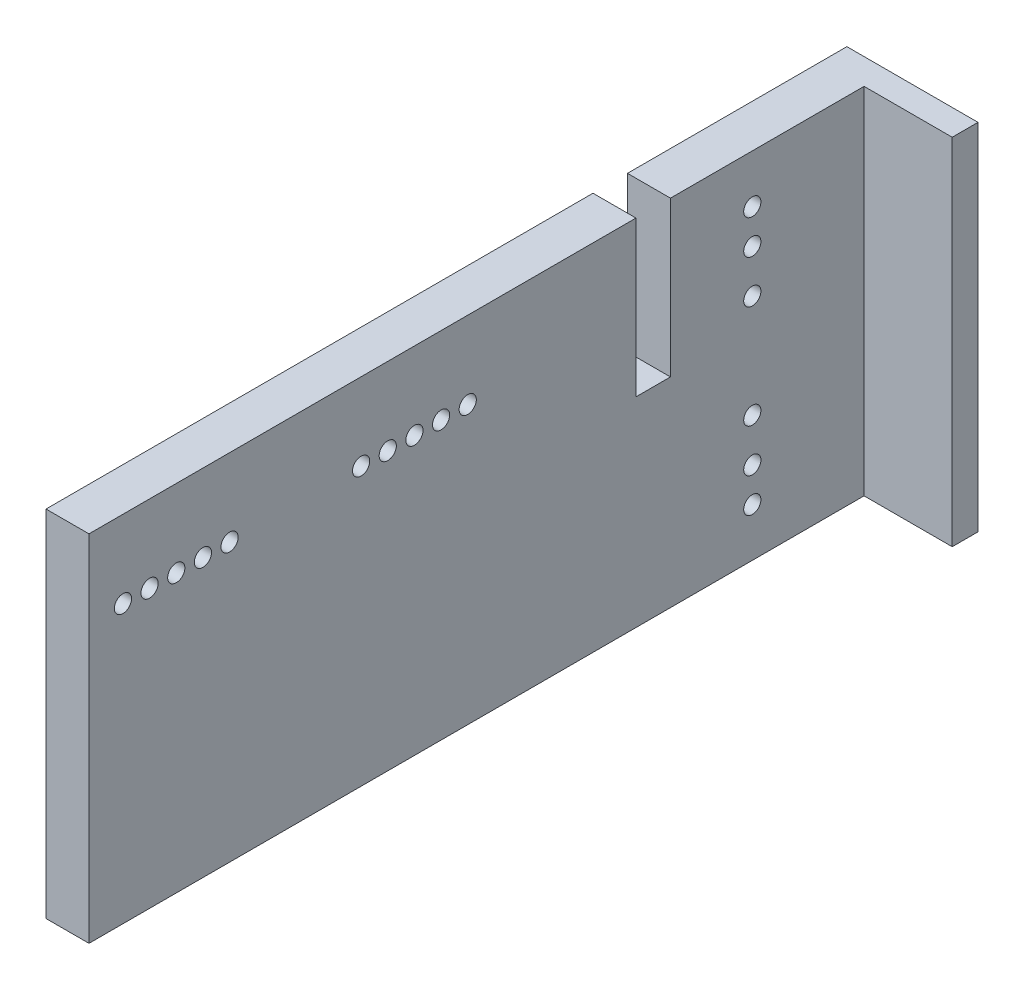
ISO-10303-21;
HEADER;
FILE_DESCRIPTION(('STEP AP214'),'2;1');
FILE_NAME('part.step','',(''),(''),'','','');
FILE_SCHEMA(('AUTOMOTIVE_DESIGN { 1 0 10303 214 1 1 1 1 }'));
ENDSEC;
DATA;
#1=APPLICATION_CONTEXT('core data for automotive mechanical design processes');
#2=APPLICATION_PROTOCOL_DEFINITION('international standard','automotive_design',2000,#1);
#3=PRODUCT_CONTEXT('',#1,'mechanical');
#4=PRODUCT('Part','Part','',(#3));
#5=PRODUCT_RELATED_PRODUCT_CATEGORY('part','',(#4));
#6=PRODUCT_DEFINITION_FORMATION('','',#4);
#7=PRODUCT_DEFINITION_CONTEXT('part definition',#1,'design');
#8=PRODUCT_DEFINITION('design','',#6,#7);
#9=PRODUCT_DEFINITION_SHAPE('','',#8);
#10=(LENGTH_UNIT() NAMED_UNIT(*) SI_UNIT(.MILLI.,.METRE.));
#11=(NAMED_UNIT(*) PLANE_ANGLE_UNIT() SI_UNIT($,.RADIAN.));
#12=(NAMED_UNIT(*) SI_UNIT($,.STERADIAN.) SOLID_ANGLE_UNIT());
#13=UNCERTAINTY_MEASURE_WITH_UNIT(LENGTH_MEASURE(1.E-05),#10,'distance_accuracy_value','');
#14=(GEOMETRIC_REPRESENTATION_CONTEXT(3) GLOBAL_UNCERTAINTY_ASSIGNED_CONTEXT((#13)) GLOBAL_UNIT_ASSIGNED_CONTEXT((#10,
#11,#12)) REPRESENTATION_CONTEXT('',''));
#15=CARTESIAN_POINT('',(0.,0.,0.));
#16=DIRECTION('',(0.,0.,1.));
#17=DIRECTION('',(1.,0.,0.));
#18=AXIS2_PLACEMENT_3D('',#15,#16,#17);
#19=CARTESIAN_POINT('',(10.25,20.625,13.));
#20=DIRECTION('',(1.,0.,0.));
#21=DIRECTION('',(0.,0.,1.));
#22=AXIS2_PLACEMENT_3D('',#19,#20,#21);
#23=PLANE('',#22);
#24=DIRECTION('',(0.,0.,-1.));
#25=VECTOR('',#24,1.);
#26=CARTESIAN_POINT('',(10.25,41.25,54.7901162303077));
#27=LINE('',#26,#25);
#28=CARTESIAN_POINT('',(10.25,41.25,0.));
#29=VERTEX_POINT('',#28);
#30=CARTESIAN_POINT('',(10.25,41.25,-3.));
#31=VERTEX_POINT('',#30);
#32=EDGE_CURVE('E180',#29,#31,#27,.T.);
#33=ORIENTED_EDGE('',*,*,#32,.F.);
#34=DIRECTION('',(0.,-1.,0.));
#35=VECTOR('',#34,1.);
#36=CARTESIAN_POINT('',(10.25,44.25,0.));
#37=LINE('',#36,#35);
#38=CARTESIAN_POINT('',(10.25,0.,0.));
#39=VERTEX_POINT('',#38);
#40=EDGE_CURVE('E11',#29,#39,#37,.T.);
#41=ORIENTED_EDGE('',*,*,#40,.T.);
#42=DIRECTION('',(0.,0.,1.));
#43=VECTOR('',#42,1.);
#44=CARTESIAN_POINT('',(10.25,0.,40.9842246334762));
#45=LINE('',#44,#43);
#46=CARTESIAN_POINT('',(10.25,0.,-3.));
#47=VERTEX_POINT('',#46);
#48=EDGE_CURVE('E199',#47,#39,#45,.T.);
#49=ORIENTED_EDGE('',*,*,#48,.F.);
#50=DIRECTION('',(0.,-1.,0.));
#51=VECTOR('',#50,1.);
#52=CARTESIAN_POINT('',(10.25,44.25,-3.));
#53=LINE('',#52,#51);
#54=EDGE_CURVE('E196',#31,#47,#53,.T.);
#55=ORIENTED_EDGE('',*,*,#54,.F.);
#56=EDGE_LOOP('',(#33,#41,#49,#55));
#57=FACE_BOUND('',#56,.T.);
#58=ADVANCED_FACE('F43',(#57),#23,.T.);
#59=CARTESIAN_POINT('',(-5.,44.25,0.));
#60=DIRECTION('',(-1.,0.,0.));
#61=DIRECTION('',(0.,0.,1.));
#62=AXIS2_PLACEMENT_3D('',#59,#60,#61);
#63=PLANE('',#62);
#64=DIRECTION('',(0.,0.,-1.));
#65=VECTOR('',#64,1.);
#66=CARTESIAN_POINT('',(-5.00000000000001,41.25,54.7901162303077));
#67=LINE('',#66,#65);
#68=CARTESIAN_POINT('',(-5.00000000000001,41.25,22.5204663648322));
#69=VERTEX_POINT('',#68);
#70=CARTESIAN_POINT('',(-5.00000000000001,41.25,-3.));
#71=VERTEX_POINT('',#70);
#72=EDGE_CURVE('E198',#69,#71,#67,.T.);
#73=ORIENTED_EDGE('',*,*,#72,.T.);
#74=DIRECTION('',(0.,-1.,0.));
#75=VECTOR('',#74,1.);
#76=CARTESIAN_POINT('',(-5.,-3.,-3.));
#77=LINE('',#76,#75);
#78=CARTESIAN_POINT('',(-5.00000000000001,0.,-3.));
#79=VERTEX_POINT('',#78);
#80=EDGE_CURVE('E189',#71,#79,#77,.T.);
#81=ORIENTED_EDGE('',*,*,#80,.T.);
#82=DIRECTION('',(0.,0.,-1.));
#83=VECTOR('',#82,1.);
#84=CARTESIAN_POINT('',(-5.,0.,90.15));
#85=LINE('',#84,#83);
#86=CARTESIAN_POINT('',(-5.,0.,90.15));
#87=VERTEX_POINT('',#86);
#88=EDGE_CURVE('E704',#87,#79,#85,.T.);
#89=ORIENTED_EDGE('',*,*,#88,.F.);
#90=DIRECTION('',(0.,-1.,0.));
#91=VECTOR('',#90,1.);
#92=CARTESIAN_POINT('',(-5.00000000000001,41.25,90.15));
#93=LINE('',#92,#91);
#94=CARTESIAN_POINT('',(-5.00000000000001,41.25,90.15));
#95=VERTEX_POINT('',#94);
#96=EDGE_CURVE('E711',#95,#87,#93,.T.);
#97=ORIENTED_EDGE('',*,*,#96,.F.);
#98=DIRECTION('',(0.,0.,-1.));
#99=VECTOR('',#98,1.);
#100=CARTESIAN_POINT('',(-5.00000000000001,41.25,90.15));
#101=LINE('',#100,#99);
#102=CARTESIAN_POINT('',(-5.00000000000001,41.25,26.5304663648323));
#103=VERTEX_POINT('',#102);
#104=EDGE_CURVE('E61',#95,#103,#101,.T.);
#105=ORIENTED_EDGE('',*,*,#104,.T.);
#106=DIRECTION('',(0.,-1.,0.));
#107=VECTOR('',#106,1.);
#108=CARTESIAN_POINT('',(-5.00000000000001,41.25,26.5304663648323));
#109=LINE('',#108,#107);
#110=CARTESIAN_POINT('',(-5.00000000000001,23.24,26.5304663648322));
#111=VERTEX_POINT('',#110);
#112=EDGE_CURVE('E832',#103,#111,#109,.T.);
#113=ORIENTED_EDGE('',*,*,#112,.T.);
#114=DIRECTION('',(0.,0.,-1.));
#115=VECTOR('',#114,1.);
#116=CARTESIAN_POINT('',(-5.00000000000001,23.24,22.5204663648322));
#117=LINE('',#116,#115);
#118=CARTESIAN_POINT('',(-5.00000000000001,23.24,22.5204663648322));
#119=VERTEX_POINT('',#118);
#120=EDGE_CURVE('E806',#111,#119,#117,.T.);
#121=ORIENTED_EDGE('',*,*,#120,.T.);
#122=DIRECTION('',(0.,1.,0.));
#123=VECTOR('',#122,1.);
#124=CARTESIAN_POINT('',(-5.00000000000001,41.25,22.5204663648322));
#125=LINE('',#124,#123);
#126=EDGE_CURVE('E819',#119,#69,#125,.T.);
#127=ORIENTED_EDGE('',*,*,#126,.T.);
#128=EDGE_LOOP('',(#73,#81,#89,#97,#105,#113,#121,#127));
#129=FACE_BOUND('',#128,.T.);
#130=CARTESIAN_POINT('',(-5.00000000000001,32.25,86.2));
#131=DIRECTION('',(1.,0.,0.));
#132=DIRECTION('',(0.,0.,-1.));
#133=AXIS2_PLACEMENT_3D('',#130,#131,#132);
#134=CIRCLE('',#133,0.999999999999998);
#135=CARTESIAN_POINT('',(-5.00000000000001,32.25,85.2));
#136=VERTEX_POINT('',#135);
#137=EDGE_CURVE('E721',#136,#136,#134,.T.);
#138=ORIENTED_EDGE('',*,*,#137,.T.);
#139=EDGE_LOOP('',(#138));
#140=FACE_BOUND('',#139,.T.);
#141=CARTESIAN_POINT('',(-5.00000000000001,32.25,49.2000000000001));
#142=DIRECTION('',(1.,0.,0.));
#143=DIRECTION('',(0.,0.,-1.));
#144=AXIS2_PLACEMENT_3D('',#141,#142,#143);
#145=CIRCLE('',#144,0.999999999999998);
#146=CARTESIAN_POINT('',(-5.00000000000001,32.25,48.2));
#147=VERTEX_POINT('',#146);
#148=EDGE_CURVE('E769',#147,#147,#145,.T.);
#149=ORIENTED_EDGE('',*,*,#148,.T.);
#150=EDGE_LOOP('',(#149));
#151=FACE_BOUND('',#150,.T.);
#152=CARTESIAN_POINT('',(-5.00000000000001,32.25,52.3));
#153=DIRECTION('',(1.,0.,0.));
#154=DIRECTION('',(0.,0.,-1.));
#155=AXIS2_PLACEMENT_3D('',#152,#153,#154);
#156=CIRCLE('',#155,0.999999999999998);
#157=CARTESIAN_POINT('',(-5.00000000000001,32.25,51.3));
#158=VERTEX_POINT('',#157);
#159=EDGE_CURVE('E777',#158,#158,#156,.T.);
#160=ORIENTED_EDGE('',*,*,#159,.T.);
#161=EDGE_LOOP('',(#160));
#162=FACE_BOUND('',#161,.T.);
#163=CARTESIAN_POINT('',(-5.00000000000001,32.25,55.4));
#164=DIRECTION('',(1.,0.,0.));
#165=DIRECTION('',(0.,0.,-1.));
#166=AXIS2_PLACEMENT_3D('',#163,#164,#165);
#167=CIRCLE('',#166,0.999999999999998);
#168=CARTESIAN_POINT('',(-5.00000000000001,32.25,54.4));
#169=VERTEX_POINT('',#168);
#170=EDGE_CURVE('E785',#169,#169,#167,.T.);
#171=ORIENTED_EDGE('',*,*,#170,.T.);
#172=EDGE_LOOP('',(#171));
#173=FACE_BOUND('',#172,.T.);
#174=CARTESIAN_POINT('',(-5.00000000000001,32.25,73.8));
#175=DIRECTION('',(1.,0.,0.));
#176=DIRECTION('',(0.,0.,-1.));
#177=AXIS2_PLACEMENT_3D('',#174,#175,#176);
#178=CIRCLE('',#177,0.999999999999998);
#179=CARTESIAN_POINT('',(-5.00000000000001,32.25,72.8));
#180=VERTEX_POINT('',#179);
#181=EDGE_CURVE('E755',#180,#180,#178,.T.);
#182=ORIENTED_EDGE('',*,*,#181,.T.);
#183=EDGE_LOOP('',(#182));
#184=FACE_BOUND('',#183,.T.);
#185=CARTESIAN_POINT('',(-5.00000000000001,32.25,58.5));
#186=DIRECTION('',(1.,0.,0.));
#187=DIRECTION('',(0.,0.,-1.));
#188=AXIS2_PLACEMENT_3D('',#185,#186,#187);
#189=CIRCLE('',#188,0.999999999999998);
#190=CARTESIAN_POINT('',(-5.00000000000001,32.25,57.5));
#191=VERTEX_POINT('',#190);
#192=EDGE_CURVE('E745',#191,#191,#189,.T.);
#193=ORIENTED_EDGE('',*,*,#192,.T.);
#194=EDGE_LOOP('',(#193));
#195=FACE_BOUND('',#194,.T.);
#196=CARTESIAN_POINT('',(-5.00000000000001,32.25,83.1));
#197=DIRECTION('',(1.,0.,0.));
#198=DIRECTION('',(0.,0.,-1.));
#199=AXIS2_PLACEMENT_3D('',#196,#197,#198);
#200=CIRCLE('',#199,0.999999999999998);
#201=CARTESIAN_POINT('',(-5.00000000000001,32.25,82.1));
#202=VERTEX_POINT('',#201);
#203=EDGE_CURVE('E736',#202,#202,#200,.T.);
#204=ORIENTED_EDGE('',*,*,#203,.T.);
#205=EDGE_LOOP('',(#204));
#206=FACE_BOUND('',#205,.T.);
#207=CARTESIAN_POINT('',(-5.00000000000001,32.25,80.));
#208=DIRECTION('',(1.,0.,0.));
#209=DIRECTION('',(0.,0.,-1.));
#210=AXIS2_PLACEMENT_3D('',#207,#208,#209);
#211=CIRCLE('',#210,0.999999999999998);
#212=CARTESIAN_POINT('',(-5.00000000000001,32.25,79.));
#213=VERTEX_POINT('',#212);
#214=EDGE_CURVE('E737',#213,#213,#211,.T.);
#215=ORIENTED_EDGE('',*,*,#214,.T.);
#216=EDGE_LOOP('',(#215));
#217=FACE_BOUND('',#216,.T.);
#218=CARTESIAN_POINT('',(-5.00000000000001,32.25,76.9));
#219=DIRECTION('',(1.,0.,0.));
#220=DIRECTION('',(0.,0.,-1.));
#221=AXIS2_PLACEMENT_3D('',#218,#219,#220);
#222=CIRCLE('',#221,0.999999999999998);
#223=CARTESIAN_POINT('',(-5.00000000000001,32.25,75.9));
#224=VERTEX_POINT('',#223);
#225=EDGE_CURVE('E754',#224,#224,#222,.T.);
#226=ORIENTED_EDGE('',*,*,#225,.T.);
#227=EDGE_LOOP('',(#226));
#228=FACE_BOUND('',#227,.T.);
#229=CARTESIAN_POINT('',(-5.00000000000001,32.25,46.1000000000001));
#230=DIRECTION('',(1.,0.,0.));
#231=DIRECTION('',(0.,0.,-1.));
#232=AXIS2_PLACEMENT_3D('',#229,#230,#231);
#233=CIRCLE('',#232,0.999999999999998);
#234=CARTESIAN_POINT('',(-5.00000000000001,32.25,45.1000000000001));
#235=VERTEX_POINT('',#234);
#236=EDGE_CURVE('E726',#235,#235,#233,.T.);
#237=ORIENTED_EDGE('',*,*,#236,.T.);
#238=EDGE_LOOP('',(#237));
#239=FACE_BOUND('',#238,.T.);
#240=CARTESIAN_POINT('',(-5.,35.625,13.));
#241=DIRECTION('',(1.,0.,0.));
#242=DIRECTION('',(0.,-1.,0.));
#243=AXIS2_PLACEMENT_3D('',#240,#241,#242);
#244=CIRCLE('',#243,1.);
#245=CARTESIAN_POINT('',(-5.,36.625,13.));
#246=VERTEX_POINT('',#245);
#247=EDGE_CURVE('E73',#246,#246,#244,.T.);
#248=ORIENTED_EDGE('',*,*,#247,.T.);
#249=EDGE_LOOP('',(#248));
#250=FACE_BOUND('',#249,.T.);
#251=CARTESIAN_POINT('',(-5.,31.625,13.));
#252=DIRECTION('',(1.,0.,0.));
#253=DIRECTION('',(0.,-1.,0.));
#254=AXIS2_PLACEMENT_3D('',#251,#252,#253);
#255=CIRCLE('',#254,1.);
#256=CARTESIAN_POINT('',(-5.,32.625,13.));
#257=VERTEX_POINT('',#256);
#258=EDGE_CURVE('E255',#257,#257,#255,.T.);
#259=ORIENTED_EDGE('',*,*,#258,.T.);
#260=EDGE_LOOP('',(#259));
#261=FACE_BOUND('',#260,.T.);
#262=CARTESIAN_POINT('',(-5.,26.625,13.));
#263=DIRECTION('',(1.,0.,0.));
#264=DIRECTION('',(0.,-1.,0.));
#265=AXIS2_PLACEMENT_3D('',#262,#263,#264);
#266=CIRCLE('',#265,1.);
#267=CARTESIAN_POINT('',(-5.,27.625,13.));
#268=VERTEX_POINT('',#267);
#269=EDGE_CURVE('E219',#268,#268,#266,.T.);
#270=ORIENTED_EDGE('',*,*,#269,.T.);
#271=EDGE_LOOP('',(#270));
#272=FACE_BOUND('',#271,.T.);
#273=CARTESIAN_POINT('',(-5.,5.625,13.));
#274=DIRECTION('',(1.,0.,0.));
#275=DIRECTION('',(0.,1.,0.));
#276=AXIS2_PLACEMENT_3D('',#273,#274,#275);
#277=CIRCLE('',#276,1.);
#278=CARTESIAN_POINT('',(-5.,4.625,13.));
#279=VERTEX_POINT('',#278);
#280=EDGE_CURVE('E278',#279,#279,#277,.T.);
#281=ORIENTED_EDGE('',*,*,#280,.T.);
#282=EDGE_LOOP('',(#281));
#283=FACE_BOUND('',#282,.T.);
#284=CARTESIAN_POINT('',(-5.,9.625,13.));
#285=DIRECTION('',(1.,0.,0.));
#286=DIRECTION('',(0.,1.,0.));
#287=AXIS2_PLACEMENT_3D('',#284,#285,#286);
#288=CIRCLE('',#287,1.);
#289=CARTESIAN_POINT('',(-5.,8.625,13.));
#290=VERTEX_POINT('',#289);
#291=EDGE_CURVE('E263',#290,#290,#288,.T.);
#292=ORIENTED_EDGE('',*,*,#291,.T.);
#293=EDGE_LOOP('',(#292));
#294=FACE_BOUND('',#293,.T.);
#295=CARTESIAN_POINT('',(-5.,14.625,13.));
#296=DIRECTION('',(1.,0.,0.));
#297=DIRECTION('',(0.,1.,0.));
#298=AXIS2_PLACEMENT_3D('',#295,#296,#297);
#299=CIRCLE('',#298,1.);
#300=CARTESIAN_POINT('',(-5.,13.625,13.));
#301=VERTEX_POINT('',#300);
#302=EDGE_CURVE('E259',#301,#301,#299,.T.);
#303=ORIENTED_EDGE('',*,*,#302,.T.);
#304=EDGE_LOOP('',(#303));
#305=FACE_BOUND('',#304,.T.);
#306=ADVANCED_FACE('F290',(#129,#140,#151,#162,#173,#184,#195,#206,#217,#228,#239,#250,#261,
#272,#283,#294,#305),#63,.T.);
#307=CARTESIAN_POINT('',(3.625,20.625,-3.));
#308=DIRECTION('',(0.,0.,-1.));
#309=DIRECTION('',(0.,-1.,0.));
#310=AXIS2_PLACEMENT_3D('',#307,#308,#309);
#311=PLANE('',#310);
#312=DIRECTION('',(-1.,0.,0.));
#313=VECTOR('',#312,1.);
#314=CARTESIAN_POINT('',(3.625,41.25,-3.));
#315=LINE('',#314,#313);
#316=EDGE_CURVE('E840',#31,#71,#315,.T.);
#317=ORIENTED_EDGE('',*,*,#316,.F.);
#318=ORIENTED_EDGE('',*,*,#54,.T.);
#319=DIRECTION('',(1.,0.,0.));
#320=VECTOR('',#319,1.);
#321=CARTESIAN_POINT('',(3.625,0.,-3.));
#322=LINE('',#321,#320);
#323=EDGE_CURVE('E828',#79,#47,#322,.T.);
#324=ORIENTED_EDGE('',*,*,#323,.F.);
#325=ORIENTED_EDGE('',*,*,#80,.F.);
#326=EDGE_LOOP('',(#317,#318,#324,#325));
#327=FACE_BOUND('',#326,.T.);
#328=ADVANCED_FACE('F45',(#327),#311,.T.);
#329=CARTESIAN_POINT('',(3.625,20.625,0.));
#330=DIRECTION('',(0.,0.,-1.));
#331=DIRECTION('',(0.,-1.,0.));
#332=AXIS2_PLACEMENT_3D('',#329,#330,#331);
#333=PLANE('',#332);
#334=ORIENTED_EDGE('',*,*,#40,.F.);
#335=DIRECTION('',(1.,0.,0.));
#336=VECTOR('',#335,1.);
#337=CARTESIAN_POINT('',(20.5,41.25,0.));
#338=LINE('',#337,#336);
#339=CARTESIAN_POINT('',(0.,41.25,0.));
#340=VERTEX_POINT('',#339);
#341=EDGE_CURVE('E53',#340,#29,#338,.T.);
#342=ORIENTED_EDGE('',*,*,#341,.F.);
#343=DIRECTION('',(0.,1.,0.));
#344=VECTOR('',#343,1.);
#345=CARTESIAN_POINT('',(0.,41.25,0.));
#346=LINE('',#345,#344);
#347=CARTESIAN_POINT('',(0.,0.,0.));
#348=VERTEX_POINT('',#347);
#349=EDGE_CURVE('E203',#348,#340,#346,.T.);
#350=ORIENTED_EDGE('',*,*,#349,.F.);
#351=DIRECTION('',(-1.,0.,0.));
#352=VECTOR('',#351,1.);
#353=CARTESIAN_POINT('',(0.,0.,0.));
#354=LINE('',#353,#352);
#355=EDGE_CURVE('E202',#39,#348,#354,.T.);
#356=ORIENTED_EDGE('',*,*,#355,.F.);
#357=EDGE_LOOP('',(#334,#342,#350,#356));
#358=FACE_BOUND('',#357,.T.);
#359=ADVANCED_FACE('F201',(#358),#333,.F.);
#360=CARTESIAN_POINT('',(0.,35.625,13.));
#361=DIRECTION('',(-1.,0.,0.));
#362=DIRECTION('',(0.,-1.,0.));
#363=AXIS2_PLACEMENT_3D('',#360,#361,#362);
#364=CYLINDRICAL_SURFACE('',#363,1.);
#365=CARTESIAN_POINT('',(0.,35.625,13.));
#366=DIRECTION('',(-1.,0.,0.));
#367=DIRECTION('',(0.,-1.,0.));
#368=AXIS2_PLACEMENT_3D('',#365,#366,#367);
#369=CIRCLE('',#368,1.);
#370=CARTESIAN_POINT('',(0.,36.625,13.));
#371=VERTEX_POINT('',#370);
#372=EDGE_CURVE('E47',#371,#371,#369,.T.);
#373=ORIENTED_EDGE('',*,*,#372,.F.);
#374=DIRECTION('',(-1.,0.,0.));
#375=VECTOR('',#374,1.);
#376=CARTESIAN_POINT('',(0.,36.625,13.));
#377=LINE('',#376,#375);
#378=EDGE_CURVE('E282',#371,#246,#377,.T.);
#379=ORIENTED_EDGE('',*,*,#378,.T.);
#380=ORIENTED_EDGE('',*,*,#247,.F.);
#381=ORIENTED_EDGE('',*,*,#378,.F.);
#382=EDGE_LOOP('',(#373,#379,#380,#381));
#383=FACE_BOUND('',#382,.T.);
#384=ADVANCED_FACE('F322',(#383),#364,.F.);
#385=CARTESIAN_POINT('',(0.,31.625,13.));
#386=DIRECTION('',(-1.,0.,0.));
#387=DIRECTION('',(0.,-1.,0.));
#388=AXIS2_PLACEMENT_3D('',#385,#386,#387);
#389=CYLINDRICAL_SURFACE('',#388,1.);
#390=CARTESIAN_POINT('',(0.,31.625,13.));
#391=DIRECTION('',(-1.,0.,0.));
#392=DIRECTION('',(0.,-1.,0.));
#393=AXIS2_PLACEMENT_3D('',#390,#391,#392);
#394=CIRCLE('',#393,1.);
#395=CARTESIAN_POINT('',(0.,32.625,13.));
#396=VERTEX_POINT('',#395);
#397=EDGE_CURVE('E250',#396,#396,#394,.T.);
#398=ORIENTED_EDGE('',*,*,#397,.F.);
#399=DIRECTION('',(-1.,0.,0.));
#400=VECTOR('',#399,1.);
#401=CARTESIAN_POINT('',(0.,32.625,13.));
#402=LINE('',#401,#400);
#403=EDGE_CURVE('E245',#396,#257,#402,.T.);
#404=ORIENTED_EDGE('',*,*,#403,.T.);
#405=ORIENTED_EDGE('',*,*,#258,.F.);
#406=ORIENTED_EDGE('',*,*,#403,.F.);
#407=EDGE_LOOP('',(#398,#404,#405,#406));
#408=FACE_BOUND('',#407,.T.);
#409=ADVANCED_FACE('F324',(#408),#389,.F.);
#410=CARTESIAN_POINT('',(0.,26.625,13.));
#411=DIRECTION('',(-1.,0.,0.));
#412=DIRECTION('',(0.,-1.,0.));
#413=AXIS2_PLACEMENT_3D('',#410,#411,#412);
#414=CYLINDRICAL_SURFACE('',#413,1.);
#415=CARTESIAN_POINT('',(0.,26.625,13.));
#416=DIRECTION('',(-1.,0.,0.));
#417=DIRECTION('',(0.,-1.,0.));
#418=AXIS2_PLACEMENT_3D('',#415,#416,#417);
#419=CIRCLE('',#418,1.);
#420=CARTESIAN_POINT('',(0.,27.625,13.));
#421=VERTEX_POINT('',#420);
#422=EDGE_CURVE('E233',#421,#421,#419,.T.);
#423=ORIENTED_EDGE('',*,*,#422,.F.);
#424=DIRECTION('',(-1.,0.,0.));
#425=VECTOR('',#424,1.);
#426=CARTESIAN_POINT('',(0.,27.625,13.));
#427=LINE('',#426,#425);
#428=EDGE_CURVE('E264',#421,#268,#427,.T.);
#429=ORIENTED_EDGE('',*,*,#428,.T.);
#430=ORIENTED_EDGE('',*,*,#269,.F.);
#431=ORIENTED_EDGE('',*,*,#428,.F.);
#432=EDGE_LOOP('',(#423,#429,#430,#431));
#433=FACE_BOUND('',#432,.T.);
#434=ADVANCED_FACE('F308',(#433),#414,.F.);
#435=CARTESIAN_POINT('',(0.,5.625,13.));
#436=DIRECTION('',(-1.,0.,0.));
#437=DIRECTION('',(0.,1.,0.));
#438=AXIS2_PLACEMENT_3D('',#435,#436,#437);
#439=CYLINDRICAL_SURFACE('',#438,1.);
#440=CARTESIAN_POINT('',(0.,5.625,13.));
#441=DIRECTION('',(-1.,0.,0.));
#442=DIRECTION('',(0.,1.,0.));
#443=AXIS2_PLACEMENT_3D('',#440,#441,#442);
#444=CIRCLE('',#443,1.);
#445=CARTESIAN_POINT('',(0.,4.625,13.));
#446=VERTEX_POINT('',#445);
#447=EDGE_CURVE('E225',#446,#446,#444,.T.);
#448=ORIENTED_EDGE('',*,*,#447,.F.);
#449=DIRECTION('',(-1.,0.,0.));
#450=VECTOR('',#449,1.);
#451=CARTESIAN_POINT('',(0.,4.625,13.));
#452=LINE('',#451,#450);
#453=EDGE_CURVE('E254',#446,#279,#452,.T.);
#454=ORIENTED_EDGE('',*,*,#453,.T.);
#455=ORIENTED_EDGE('',*,*,#280,.F.);
#456=ORIENTED_EDGE('',*,*,#453,.F.);
#457=EDGE_LOOP('',(#448,#454,#455,#456));
#458=FACE_BOUND('',#457,.T.);
#459=ADVANCED_FACE('F296',(#458),#439,.F.);
#460=CARTESIAN_POINT('',(0.,9.625,13.));
#461=DIRECTION('',(-1.,0.,0.));
#462=DIRECTION('',(0.,1.,0.));
#463=AXIS2_PLACEMENT_3D('',#460,#461,#462);
#464=CYLINDRICAL_SURFACE('',#463,1.);
#465=CARTESIAN_POINT('',(0.,9.625,13.));
#466=DIRECTION('',(-1.,0.,0.));
#467=DIRECTION('',(0.,1.,0.));
#468=AXIS2_PLACEMENT_3D('',#465,#466,#467);
#469=CIRCLE('',#468,1.);
#470=CARTESIAN_POINT('',(0.,8.625,13.));
#471=VERTEX_POINT('',#470);
#472=EDGE_CURVE('E222',#471,#471,#469,.T.);
#473=ORIENTED_EDGE('',*,*,#472,.F.);
#474=DIRECTION('',(-1.,0.,0.));
#475=VECTOR('',#474,1.);
#476=CARTESIAN_POINT('',(0.,8.625,13.));
#477=LINE('',#476,#475);
#478=EDGE_CURVE('E214',#471,#290,#477,.T.);
#479=ORIENTED_EDGE('',*,*,#478,.T.);
#480=ORIENTED_EDGE('',*,*,#291,.F.);
#481=ORIENTED_EDGE('',*,*,#478,.F.);
#482=EDGE_LOOP('',(#473,#479,#480,#481));
#483=FACE_BOUND('',#482,.T.);
#484=ADVANCED_FACE('F293',(#483),#464,.F.);
#485=CARTESIAN_POINT('',(0.,14.625,13.));
#486=DIRECTION('',(-1.,0.,0.));
#487=DIRECTION('',(0.,1.,0.));
#488=AXIS2_PLACEMENT_3D('',#485,#486,#487);
#489=CYLINDRICAL_SURFACE('',#488,1.);
#490=CARTESIAN_POINT('',(0.,14.625,13.));
#491=DIRECTION('',(-1.,0.,0.));
#492=DIRECTION('',(0.,1.,0.));
#493=AXIS2_PLACEMENT_3D('',#490,#491,#492);
#494=CIRCLE('',#493,1.);
#495=CARTESIAN_POINT('',(0.,13.625,13.));
#496=VERTEX_POINT('',#495);
#497=EDGE_CURVE('E226',#496,#496,#494,.T.);
#498=ORIENTED_EDGE('',*,*,#497,.F.);
#499=DIRECTION('',(-1.,0.,0.));
#500=VECTOR('',#499,1.);
#501=CARTESIAN_POINT('',(0.,13.625,13.));
#502=LINE('',#501,#500);
#503=EDGE_CURVE('E207',#496,#301,#502,.T.);
#504=ORIENTED_EDGE('',*,*,#503,.T.);
#505=ORIENTED_EDGE('',*,*,#302,.F.);
#506=ORIENTED_EDGE('',*,*,#503,.F.);
#507=EDGE_LOOP('',(#498,#504,#505,#506));
#508=FACE_BOUND('',#507,.T.);
#509=ADVANCED_FACE('F295',(#508),#489,.F.);
#510=CARTESIAN_POINT('',(0.,0.,0.));
#511=DIRECTION('',(1.,0.,0.));
#512=DIRECTION('',(0.,1.,0.));
#513=AXIS2_PLACEMENT_3D('',#510,#511,#512);
#514=PLANE('',#513);
#515=DIRECTION('',(0.,1.,0.));
#516=VECTOR('',#515,1.);
#517=CARTESIAN_POINT('',(0.,41.25,22.5204663648322));
#518=LINE('',#517,#516);
#519=CARTESIAN_POINT('',(0.,23.24,22.5204663648322));
#520=VERTEX_POINT('',#519);
#521=CARTESIAN_POINT('',(0.,41.25,22.5204663648322));
#522=VERTEX_POINT('',#521);
#523=EDGE_CURVE('E824',#520,#522,#518,.T.);
#524=ORIENTED_EDGE('',*,*,#523,.F.);
#525=DIRECTION('',(0.,0.,-1.));
#526=VECTOR('',#525,1.);
#527=CARTESIAN_POINT('',(0.,23.24,22.5204663648322));
#528=LINE('',#527,#526);
#529=CARTESIAN_POINT('',(0.,23.24,26.5304663648322));
#530=VERTEX_POINT('',#529);
#531=EDGE_CURVE('E815',#530,#520,#528,.T.);
#532=ORIENTED_EDGE('',*,*,#531,.F.);
#533=DIRECTION('',(0.,-1.,0.));
#534=VECTOR('',#533,1.);
#535=CARTESIAN_POINT('',(0.,41.25,26.5304663648323));
#536=LINE('',#535,#534);
#537=CARTESIAN_POINT('',(0.,41.25,26.5304663648323));
#538=VERTEX_POINT('',#537);
#539=EDGE_CURVE('E820',#538,#530,#536,.T.);
#540=ORIENTED_EDGE('',*,*,#539,.F.);
#541=DIRECTION('',(0.,0.,-1.));
#542=VECTOR('',#541,1.);
#543=CARTESIAN_POINT('',(0.,41.25,90.15));
#544=LINE('',#543,#542);
#545=CARTESIAN_POINT('',(0.,41.25,90.15));
#546=VERTEX_POINT('',#545);
#547=EDGE_CURVE('E236',#546,#538,#544,.T.);
#548=ORIENTED_EDGE('',*,*,#547,.F.);
#549=DIRECTION('',(0.,1.,0.));
#550=VECTOR('',#549,1.);
#551=CARTESIAN_POINT('',(0.,41.25,90.15));
#552=LINE('',#551,#550);
#553=CARTESIAN_POINT('',(0.,0.,90.15));
#554=VERTEX_POINT('',#553);
#555=EDGE_CURVE('E717',#554,#546,#552,.T.);
#556=ORIENTED_EDGE('',*,*,#555,.F.);
#557=DIRECTION('',(0.,0.,1.));
#558=VECTOR('',#557,1.);
#559=CARTESIAN_POINT('',(0.,0.,0.));
#560=LINE('',#559,#558);
#561=EDGE_CURVE('E208',#348,#554,#560,.T.);
#562=ORIENTED_EDGE('',*,*,#561,.F.);
#563=ORIENTED_EDGE('',*,*,#349,.T.);
#564=DIRECTION('',(0.,0.,1.));
#565=VECTOR('',#564,1.);
#566=CARTESIAN_POINT('',(0.,41.25,0.));
#567=LINE('',#566,#565);
#568=EDGE_CURVE('E183',#340,#522,#567,.T.);
#569=ORIENTED_EDGE('',*,*,#568,.T.);
#570=EDGE_LOOP('',(#524,#532,#540,#548,#556,#562,#563,#569));
#571=FACE_BOUND('',#570,.T.);
#572=CARTESIAN_POINT('',(0.,32.25,86.2));
#573=DIRECTION('',(1.,0.,0.));
#574=DIRECTION('',(0.,0.,-1.));
#575=AXIS2_PLACEMENT_3D('',#572,#573,#574);
#576=CIRCLE('',#575,0.999999999999998);
#577=CARTESIAN_POINT('',(0.,32.25,85.2));
#578=VERTEX_POINT('',#577);
#579=EDGE_CURVE('E749',#578,#578,#576,.T.);
#580=ORIENTED_EDGE('',*,*,#579,.F.);
#581=EDGE_LOOP('',(#580));
#582=FACE_BOUND('',#581,.T.);
#583=CARTESIAN_POINT('',(0.,32.25,49.2000000000001));
#584=DIRECTION('',(1.,0.,0.));
#585=DIRECTION('',(0.,0.,-1.));
#586=AXIS2_PLACEMENT_3D('',#583,#584,#585);
#587=CIRCLE('',#586,0.999999999999998);
#588=CARTESIAN_POINT('',(0.,32.25,48.2));
#589=VERTEX_POINT('',#588);
#590=EDGE_CURVE('E731',#589,#589,#587,.T.);
#591=ORIENTED_EDGE('',*,*,#590,.F.);
#592=EDGE_LOOP('',(#591));
#593=FACE_BOUND('',#592,.T.);
#594=CARTESIAN_POINT('',(0.,32.25,52.3));
#595=DIRECTION('',(1.,0.,0.));
#596=DIRECTION('',(0.,0.,-1.));
#597=AXIS2_PLACEMENT_3D('',#594,#595,#596);
#598=CIRCLE('',#597,0.999999999999998);
#599=CARTESIAN_POINT('',(0.,32.25,51.3));
#600=VERTEX_POINT('',#599);
#601=EDGE_CURVE('E773',#600,#600,#598,.T.);
#602=ORIENTED_EDGE('',*,*,#601,.F.);
#603=EDGE_LOOP('',(#602));
#604=FACE_BOUND('',#603,.T.);
#605=CARTESIAN_POINT('',(0.,32.25,55.4));
#606=DIRECTION('',(1.,0.,0.));
#607=DIRECTION('',(0.,0.,-1.));
#608=AXIS2_PLACEMENT_3D('',#605,#606,#607);
#609=CIRCLE('',#608,0.999999999999998);
#610=CARTESIAN_POINT('',(0.,32.25,54.4));
#611=VERTEX_POINT('',#610);
#612=EDGE_CURVE('E781',#611,#611,#609,.T.);
#613=ORIENTED_EDGE('',*,*,#612,.F.);
#614=EDGE_LOOP('',(#613));
#615=FACE_BOUND('',#614,.T.);
#616=CARTESIAN_POINT('',(0.,32.25,73.8));
#617=DIRECTION('',(1.,0.,0.));
#618=DIRECTION('',(0.,0.,-1.));
#619=AXIS2_PLACEMENT_3D('',#616,#617,#618);
#620=CIRCLE('',#619,0.999999999999998);
#621=CARTESIAN_POINT('',(0.,32.25,72.8));
#622=VERTEX_POINT('',#621);
#623=EDGE_CURVE('E789',#622,#622,#620,.T.);
#624=ORIENTED_EDGE('',*,*,#623,.F.);
#625=EDGE_LOOP('',(#624));
#626=FACE_BOUND('',#625,.T.);
#627=CARTESIAN_POINT('',(0.,32.25,58.5));
#628=DIRECTION('',(1.,0.,0.));
#629=DIRECTION('',(0.,0.,-1.));
#630=AXIS2_PLACEMENT_3D('',#627,#628,#629);
#631=CIRCLE('',#630,0.999999999999998);
#632=CARTESIAN_POINT('',(0.,32.25,57.5));
#633=VERTEX_POINT('',#632);
#634=EDGE_CURVE('E741',#633,#633,#631,.T.);
#635=ORIENTED_EDGE('',*,*,#634,.F.);
#636=EDGE_LOOP('',(#635));
#637=FACE_BOUND('',#636,.T.);
#638=CARTESIAN_POINT('',(0.,32.25,83.1));
#639=DIRECTION('',(1.,0.,0.));
#640=DIRECTION('',(0.,0.,-1.));
#641=AXIS2_PLACEMENT_3D('',#638,#639,#640);
#642=CIRCLE('',#641,0.999999999999998);
#643=CARTESIAN_POINT('',(0.,32.25,82.1));
#644=VERTEX_POINT('',#643);
#645=EDGE_CURVE('E732',#644,#644,#642,.T.);
#646=ORIENTED_EDGE('',*,*,#645,.F.);
#647=EDGE_LOOP('',(#646));
#648=FACE_BOUND('',#647,.T.);
#649=CARTESIAN_POINT('',(0.,32.25,80.));
#650=DIRECTION('',(1.,0.,0.));
#651=DIRECTION('',(0.,0.,-1.));
#652=AXIS2_PLACEMENT_3D('',#649,#650,#651);
#653=CIRCLE('',#652,0.999999999999998);
#654=CARTESIAN_POINT('',(0.,32.25,79.));
#655=VERTEX_POINT('',#654);
#656=EDGE_CURVE('E759',#655,#655,#653,.T.);
#657=ORIENTED_EDGE('',*,*,#656,.F.);
#658=EDGE_LOOP('',(#657));
#659=FACE_BOUND('',#658,.T.);
#660=CARTESIAN_POINT('',(0.,32.25,76.9));
#661=DIRECTION('',(1.,0.,0.));
#662=DIRECTION('',(0.,0.,-1.));
#663=AXIS2_PLACEMENT_3D('',#660,#661,#662);
#664=CIRCLE('',#663,0.999999999999998);
#665=CARTESIAN_POINT('',(0.,32.25,75.9));
#666=VERTEX_POINT('',#665);
#667=EDGE_CURVE('E750',#666,#666,#664,.T.);
#668=ORIENTED_EDGE('',*,*,#667,.F.);
#669=EDGE_LOOP('',(#668));
#670=FACE_BOUND('',#669,.T.);
#671=CARTESIAN_POINT('',(0.,32.25,46.1000000000001));
#672=DIRECTION('',(1.,0.,0.));
#673=DIRECTION('',(0.,0.,-1.));
#674=AXIS2_PLACEMENT_3D('',#671,#672,#673);
#675=CIRCLE('',#674,0.999999999999998);
#676=CARTESIAN_POINT('',(0.,32.25,45.1000000000001));
#677=VERTEX_POINT('',#676);
#678=EDGE_CURVE('E722',#677,#677,#675,.T.);
#679=ORIENTED_EDGE('',*,*,#678,.F.);
#680=EDGE_LOOP('',(#679));
#681=FACE_BOUND('',#680,.T.);
#682=ORIENTED_EDGE('',*,*,#372,.T.);
#683=EDGE_LOOP('',(#682));
#684=FACE_BOUND('',#683,.T.);
#685=ORIENTED_EDGE('',*,*,#397,.T.);
#686=EDGE_LOOP('',(#685));
#687=FACE_BOUND('',#686,.T.);
#688=ORIENTED_EDGE('',*,*,#422,.T.);
#689=EDGE_LOOP('',(#688));
#690=FACE_BOUND('',#689,.T.);
#691=ORIENTED_EDGE('',*,*,#447,.T.);
#692=EDGE_LOOP('',(#691));
#693=FACE_BOUND('',#692,.T.);
#694=ORIENTED_EDGE('',*,*,#472,.T.);
#695=EDGE_LOOP('',(#694));
#696=FACE_BOUND('',#695,.T.);
#697=ORIENTED_EDGE('',*,*,#497,.T.);
#698=EDGE_LOOP('',(#697));
#699=FACE_BOUND('',#698,.T.);
#700=ADVANCED_FACE('F304',(#571,#582,#593,#604,#615,#626,#637,#648,#659,#670,#681,#684,#687,
#690,#693,#696,#699),#514,.T.);
#701=CARTESIAN_POINT('',(0.,41.25,90.15));
#702=DIRECTION('',(0.,-1.,0.));
#703=DIRECTION('',(0.,0.,-1.));
#704=AXIS2_PLACEMENT_3D('',#701,#702,#703);
#705=PLANE('',#704);
#706=ORIENTED_EDGE('',*,*,#547,.T.);
#707=DIRECTION('',(1.,0.,0.));
#708=VECTOR('',#707,1.);
#709=CARTESIAN_POINT('',(-5.00000000000001,41.25,26.5304663648323));
#710=LINE('',#709,#708);
#711=EDGE_CURVE('E805',#103,#538,#710,.T.);
#712=ORIENTED_EDGE('',*,*,#711,.F.);
#713=ORIENTED_EDGE('',*,*,#104,.F.);
#714=DIRECTION('',(-1.,0.,0.));
#715=VECTOR('',#714,1.);
#716=CARTESIAN_POINT('',(0.,41.25,90.15));
#717=LINE('',#716,#715);
#718=EDGE_CURVE('E714',#546,#95,#717,.T.);
#719=ORIENTED_EDGE('',*,*,#718,.F.);
#720=EDGE_LOOP('',(#706,#712,#713,#719));
#721=FACE_BOUND('',#720,.T.);
#722=ADVANCED_FACE('F379',(#721),#705,.F.);
#723=CARTESIAN_POINT('',(0.,0.,90.15));
#724=DIRECTION('',(0.,1.,0.));
#725=DIRECTION('',(0.,0.,1.));
#726=AXIS2_PLACEMENT_3D('',#723,#724,#725);
#727=PLANE('',#726);
#728=ORIENTED_EDGE('',*,*,#88,.T.);
#729=ORIENTED_EDGE('',*,*,#323,.T.);
#730=ORIENTED_EDGE('',*,*,#48,.T.);
#731=ORIENTED_EDGE('',*,*,#355,.T.);
#732=ORIENTED_EDGE('',*,*,#561,.T.);
#733=DIRECTION('',(1.,0.,0.));
#734=VECTOR('',#733,1.);
#735=CARTESIAN_POINT('',(0.,0.,90.15));
#736=LINE('',#735,#734);
#737=EDGE_CURVE('E707',#87,#554,#736,.T.);
#738=ORIENTED_EDGE('',*,*,#737,.F.);
#739=EDGE_LOOP('',(#728,#729,#730,#731,#732,#738));
#740=FACE_BOUND('',#739,.T.);
#741=ADVANCED_FACE('F386',(#740),#727,.F.);
#742=CARTESIAN_POINT('',(0.,0.,90.15));
#743=DIRECTION('',(0.,0.,-1.));
#744=DIRECTION('',(-1.,0.,0.));
#745=AXIS2_PLACEMENT_3D('',#742,#743,#744);
#746=PLANE('',#745);
#747=ORIENTED_EDGE('',*,*,#555,.T.);
#748=ORIENTED_EDGE('',*,*,#718,.T.);
#749=ORIENTED_EDGE('',*,*,#96,.T.);
#750=ORIENTED_EDGE('',*,*,#737,.T.);
#751=EDGE_LOOP('',(#747,#748,#749,#750));
#752=FACE_BOUND('',#751,.T.);
#753=ADVANCED_FACE('F394',(#752),#746,.F.);
#754=CARTESIAN_POINT('',(-5.00000000000001,32.25,46.1000000000001));
#755=DIRECTION('',(1.,0.,0.));
#756=DIRECTION('',(0.,0.,-1.));
#757=AXIS2_PLACEMENT_3D('',#754,#755,#756);
#758=CYLINDRICAL_SURFACE('',#757,0.999999999999998);
#759=ORIENTED_EDGE('',*,*,#236,.F.);
#760=EDGE_LOOP('',(#759));
#761=FACE_BOUND('',#760,.T.);
#762=ORIENTED_EDGE('',*,*,#678,.T.);
#763=EDGE_LOOP('',(#762));
#764=FACE_BOUND('',#763,.T.);
#765=ADVANCED_FACE('F402',(#761,#764),#758,.F.);
#766=CARTESIAN_POINT('',(-5.00000000000001,32.25,76.9));
#767=DIRECTION('',(1.,0.,0.));
#768=DIRECTION('',(0.,0.,-1.));
#769=AXIS2_PLACEMENT_3D('',#766,#767,#768);
#770=CYLINDRICAL_SURFACE('',#769,0.999999999999998);
#771=ORIENTED_EDGE('',*,*,#225,.F.);
#772=EDGE_LOOP('',(#771));
#773=FACE_BOUND('',#772,.T.);
#774=ORIENTED_EDGE('',*,*,#667,.T.);
#775=EDGE_LOOP('',(#774));
#776=FACE_BOUND('',#775,.T.);
#777=ADVANCED_FACE('F411',(#773,#776),#770,.F.);
#778=CARTESIAN_POINT('',(-5.00000000000001,32.25,80.));
#779=DIRECTION('',(1.,0.,0.));
#780=DIRECTION('',(0.,0.,-1.));
#781=AXIS2_PLACEMENT_3D('',#778,#779,#780);
#782=CYLINDRICAL_SURFACE('',#781,0.999999999999998);
#783=ORIENTED_EDGE('',*,*,#214,.F.);
#784=EDGE_LOOP('',(#783));
#785=FACE_BOUND('',#784,.T.);
#786=ORIENTED_EDGE('',*,*,#656,.T.);
#787=EDGE_LOOP('',(#786));
#788=FACE_BOUND('',#787,.T.);
#789=ADVANCED_FACE('F419',(#785,#788),#782,.F.);
#790=CARTESIAN_POINT('',(-5.00000000000001,32.25,83.1));
#791=DIRECTION('',(1.,0.,0.));
#792=DIRECTION('',(0.,0.,-1.));
#793=AXIS2_PLACEMENT_3D('',#790,#791,#792);
#794=CYLINDRICAL_SURFACE('',#793,0.999999999999998);
#795=ORIENTED_EDGE('',*,*,#203,.F.);
#796=EDGE_LOOP('',(#795));
#797=FACE_BOUND('',#796,.T.);
#798=ORIENTED_EDGE('',*,*,#645,.T.);
#799=EDGE_LOOP('',(#798));
#800=FACE_BOUND('',#799,.T.);
#801=ADVANCED_FACE('F427',(#797,#800),#794,.F.);
#802=CARTESIAN_POINT('',(-5.00000000000001,32.25,58.5));
#803=DIRECTION('',(1.,0.,0.));
#804=DIRECTION('',(0.,0.,-1.));
#805=AXIS2_PLACEMENT_3D('',#802,#803,#804);
#806=CYLINDRICAL_SURFACE('',#805,0.999999999999998);
#807=ORIENTED_EDGE('',*,*,#192,.F.);
#808=EDGE_LOOP('',(#807));
#809=FACE_BOUND('',#808,.T.);
#810=ORIENTED_EDGE('',*,*,#634,.T.);
#811=EDGE_LOOP('',(#810));
#812=FACE_BOUND('',#811,.T.);
#813=ADVANCED_FACE('F435',(#809,#812),#806,.F.);
#814=CARTESIAN_POINT('',(-5.00000000000001,32.25,73.8));
#815=DIRECTION('',(1.,0.,0.));
#816=DIRECTION('',(0.,0.,-1.));
#817=AXIS2_PLACEMENT_3D('',#814,#815,#816);
#818=CYLINDRICAL_SURFACE('',#817,0.999999999999998);
#819=ORIENTED_EDGE('',*,*,#181,.F.);
#820=EDGE_LOOP('',(#819));
#821=FACE_BOUND('',#820,.T.);
#822=ORIENTED_EDGE('',*,*,#623,.T.);
#823=EDGE_LOOP('',(#822));
#824=FACE_BOUND('',#823,.T.);
#825=ADVANCED_FACE('F443',(#821,#824),#818,.F.);
#826=CARTESIAN_POINT('',(-5.00000000000001,32.25,55.4));
#827=DIRECTION('',(1.,0.,0.));
#828=DIRECTION('',(0.,0.,-1.));
#829=AXIS2_PLACEMENT_3D('',#826,#827,#828);
#830=CYLINDRICAL_SURFACE('',#829,0.999999999999998);
#831=ORIENTED_EDGE('',*,*,#170,.F.);
#832=EDGE_LOOP('',(#831));
#833=FACE_BOUND('',#832,.T.);
#834=ORIENTED_EDGE('',*,*,#612,.T.);
#835=EDGE_LOOP('',(#834));
#836=FACE_BOUND('',#835,.T.);
#837=ADVANCED_FACE('F451',(#833,#836),#830,.F.);
#838=CARTESIAN_POINT('',(-5.00000000000001,32.25,52.3));
#839=DIRECTION('',(1.,0.,0.));
#840=DIRECTION('',(0.,0.,-1.));
#841=AXIS2_PLACEMENT_3D('',#838,#839,#840);
#842=CYLINDRICAL_SURFACE('',#841,0.999999999999998);
#843=ORIENTED_EDGE('',*,*,#159,.F.);
#844=EDGE_LOOP('',(#843));
#845=FACE_BOUND('',#844,.T.);
#846=ORIENTED_EDGE('',*,*,#601,.T.);
#847=EDGE_LOOP('',(#846));
#848=FACE_BOUND('',#847,.T.);
#849=ADVANCED_FACE('F459',(#845,#848),#842,.F.);
#850=CARTESIAN_POINT('',(-5.00000000000001,32.25,49.2000000000001));
#851=DIRECTION('',(1.,0.,0.));
#852=DIRECTION('',(0.,0.,-1.));
#853=AXIS2_PLACEMENT_3D('',#850,#851,#852);
#854=CYLINDRICAL_SURFACE('',#853,0.999999999999998);
#855=ORIENTED_EDGE('',*,*,#148,.F.);
#856=EDGE_LOOP('',(#855));
#857=FACE_BOUND('',#856,.T.);
#858=ORIENTED_EDGE('',*,*,#590,.T.);
#859=EDGE_LOOP('',(#858));
#860=FACE_BOUND('',#859,.T.);
#861=ADVANCED_FACE('F467',(#857,#860),#854,.F.);
#862=CARTESIAN_POINT('',(-5.00000000000001,32.25,86.2));
#863=DIRECTION('',(1.,0.,0.));
#864=DIRECTION('',(0.,0.,-1.));
#865=AXIS2_PLACEMENT_3D('',#862,#863,#864);
#866=CYLINDRICAL_SURFACE('',#865,0.999999999999998);
#867=ORIENTED_EDGE('',*,*,#137,.F.);
#868=EDGE_LOOP('',(#867));
#869=FACE_BOUND('',#868,.T.);
#870=ORIENTED_EDGE('',*,*,#579,.T.);
#871=EDGE_LOOP('',(#870));
#872=FACE_BOUND('',#871,.T.);
#873=ADVANCED_FACE('F475',(#869,#872),#866,.F.);
#874=CARTESIAN_POINT('',(-5.00000000000001,41.25,22.5204663648322));
#875=DIRECTION('',(0.,0.,-1.));
#876=DIRECTION('',(-1.,0.,0.));
#877=AXIS2_PLACEMENT_3D('',#874,#875,#876);
#878=PLANE('',#877);
#879=ORIENTED_EDGE('',*,*,#523,.T.);
#880=DIRECTION('',(1.,0.,0.));
#881=VECTOR('',#880,1.);
#882=CARTESIAN_POINT('',(-5.00000000000001,41.25,22.5204663648322));
#883=LINE('',#882,#881);
#884=EDGE_CURVE('E802',#69,#522,#883,.T.);
#885=ORIENTED_EDGE('',*,*,#884,.F.);
#886=ORIENTED_EDGE('',*,*,#126,.F.);
#887=DIRECTION('',(1.,0.,0.));
#888=VECTOR('',#887,1.);
#889=CARTESIAN_POINT('',(-5.00000000000001,23.24,22.5204663648322));
#890=LINE('',#889,#888);
#891=EDGE_CURVE('E727',#119,#520,#890,.T.);
#892=ORIENTED_EDGE('',*,*,#891,.T.);
#893=EDGE_LOOP('',(#879,#885,#886,#892));
#894=FACE_BOUND('',#893,.T.);
#895=ADVANCED_FACE('F483',(#894),#878,.F.);
#896=CARTESIAN_POINT('',(-5.00000000000001,23.24,22.5204663648322));
#897=DIRECTION('',(0.,-1.,0.));
#898=DIRECTION('',(1.,0.,0.));
#899=AXIS2_PLACEMENT_3D('',#896,#897,#898);
#900=PLANE('',#899);
#901=ORIENTED_EDGE('',*,*,#531,.T.);
#902=ORIENTED_EDGE('',*,*,#891,.F.);
#903=ORIENTED_EDGE('',*,*,#120,.F.);
#904=DIRECTION('',(1.,0.,0.));
#905=VECTOR('',#904,1.);
#906=CARTESIAN_POINT('',(-5.00000000000001,23.24,26.5304663648322));
#907=LINE('',#906,#905);
#908=EDGE_CURVE('E810',#111,#530,#907,.T.);
#909=ORIENTED_EDGE('',*,*,#908,.T.);
#910=EDGE_LOOP('',(#901,#902,#903,#909));
#911=FACE_BOUND('',#910,.T.);
#912=ADVANCED_FACE('F491',(#911),#900,.F.);
#913=CARTESIAN_POINT('',(-5.00000000000001,41.25,26.5304663648323));
#914=DIRECTION('',(0.,0.,1.));
#915=DIRECTION('',(0.,-1.,0.));
#916=AXIS2_PLACEMENT_3D('',#913,#914,#915);
#917=PLANE('',#916);
#918=ORIENTED_EDGE('',*,*,#539,.T.);
#919=ORIENTED_EDGE('',*,*,#908,.F.);
#920=ORIENTED_EDGE('',*,*,#112,.F.);
#921=ORIENTED_EDGE('',*,*,#711,.T.);
#922=EDGE_LOOP('',(#918,#919,#920,#921));
#923=FACE_BOUND('',#922,.T.);
#924=ADVANCED_FACE('F499',(#923),#917,.F.);
#925=CARTESIAN_POINT('',(-5.00000000000001,41.25,54.7901162303077));
#926=DIRECTION('',(0.,-1.,0.));
#927=DIRECTION('',(0.,0.,-1.));
#928=AXIS2_PLACEMENT_3D('',#925,#926,#927);
#929=PLANE('',#928);
#930=ORIENTED_EDGE('',*,*,#316,.T.);
#931=ORIENTED_EDGE('',*,*,#72,.F.);
#932=ORIENTED_EDGE('',*,*,#884,.T.);
#933=ORIENTED_EDGE('',*,*,#568,.F.);
#934=ORIENTED_EDGE('',*,*,#341,.T.);
#935=ORIENTED_EDGE('',*,*,#32,.T.);
#936=EDGE_LOOP('',(#930,#931,#932,#933,#934,#935));
#937=FACE_BOUND('',#936,.T.);
#938=ADVANCED_FACE('F179',(#937),#929,.F.);
#939=CLOSED_SHELL('',(#58,#306,#328,#359,#384,#409,#434,#459,#484,#509,#700,#722,#741,#753,#765,
#777,#789,#801,#813,#825,#837,#849,#861,#873,#895,#912,#924,#938));
#940=MANIFOLD_SOLID_BREP('B2',#939);
#941=ADVANCED_BREP_SHAPE_REPRESENTATION('',(#18,#940),#14);
#942=SHAPE_DEFINITION_REPRESENTATION(#9,#941);
ENDSEC;
END-ISO-10303-21;
